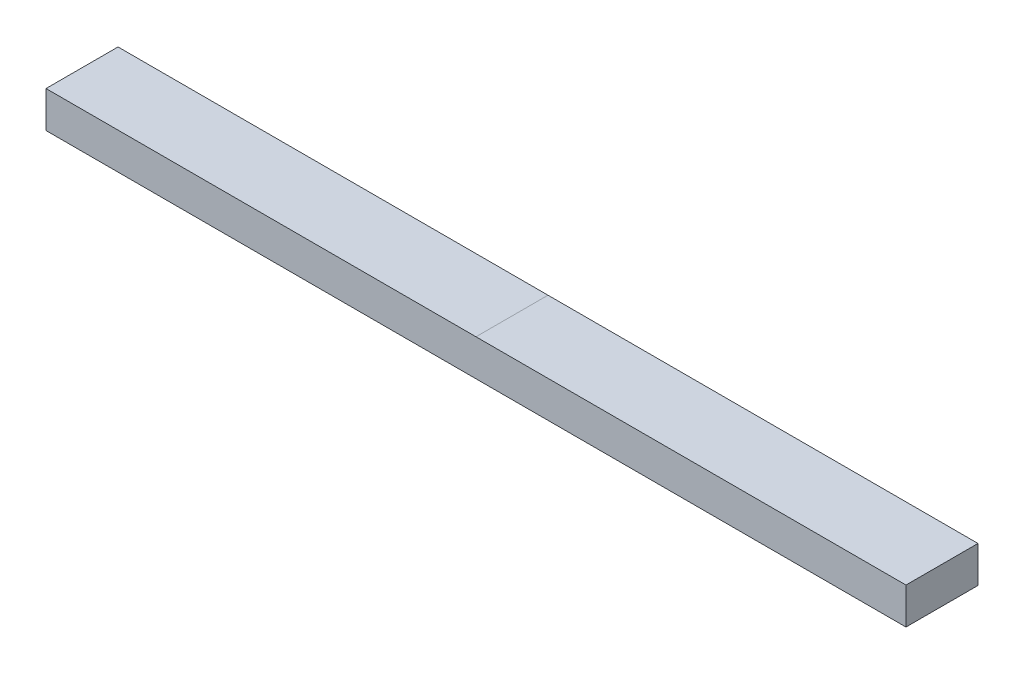
ISO-10303-21;
HEADER;
FILE_DESCRIPTION(('STEP AP214'),'2;1');
FILE_NAME('part.step','',(''),(''),'','','');
FILE_SCHEMA(('AUTOMOTIVE_DESIGN { 1 0 10303 214 1 1 1 1 }'));
ENDSEC;
DATA;
#1=APPLICATION_CONTEXT('core data for automotive mechanical design processes');
#2=APPLICATION_PROTOCOL_DEFINITION('international standard','automotive_design',2000,#1);
#3=PRODUCT_CONTEXT('',#1,'mechanical');
#4=PRODUCT('Part','Part','',(#3));
#5=PRODUCT_RELATED_PRODUCT_CATEGORY('part','',(#4));
#6=PRODUCT_DEFINITION_FORMATION('','',#4);
#7=PRODUCT_DEFINITION_CONTEXT('part definition',#1,'design');
#8=PRODUCT_DEFINITION('design','',#6,#7);
#9=PRODUCT_DEFINITION_SHAPE('','',#8);
#10=(LENGTH_UNIT() NAMED_UNIT(*) SI_UNIT(.MILLI.,.METRE.));
#11=(NAMED_UNIT(*) PLANE_ANGLE_UNIT() SI_UNIT($,.RADIAN.));
#12=(NAMED_UNIT(*) SI_UNIT($,.STERADIAN.) SOLID_ANGLE_UNIT());
#13=UNCERTAINTY_MEASURE_WITH_UNIT(LENGTH_MEASURE(1.E-05),#10,'distance_accuracy_value','');
#14=(GEOMETRIC_REPRESENTATION_CONTEXT(3) GLOBAL_UNCERTAINTY_ASSIGNED_CONTEXT((#13)) GLOBAL_UNIT_ASSIGNED_CONTEXT((#10,
#11,#12)) REPRESENTATION_CONTEXT('',''));
#15=CARTESIAN_POINT('',(0.,0.,0.));
#16=DIRECTION('',(0.,0.,1.));
#17=DIRECTION('',(1.,0.,0.));
#18=AXIS2_PLACEMENT_3D('',#15,#16,#17);
#19=CARTESIAN_POINT('',(76.2,3.2258,6.38175));
#20=DIRECTION('',(0.,1.,0.));
#21=DIRECTION('',(0.,0.,1.));
#22=AXIS2_PLACEMENT_3D('',#19,#20,#21);
#23=PLANE('',#22);
#24=DIRECTION('',(-1.,0.,0.));
#25=VECTOR('',#24,1.);
#26=CARTESIAN_POINT('',(76.2,3.2258,6.38175));
#27=LINE('',#26,#25);
#28=CARTESIAN_POINT('',(0.,3.2258,6.38175));
#29=VERTEX_POINT('',#28);
#30=CARTESIAN_POINT('',(-76.2,3.2258,6.38175));
#31=VERTEX_POINT('',#30);
#32=EDGE_CURVE('E106',#29,#31,#27,.T.);
#33=ORIENTED_EDGE('',*,*,#32,.F.);
#34=DIRECTION('',(0.,0.,-1.));
#35=VECTOR('',#34,1.);
#36=CARTESIAN_POINT('',(0.,3.2258,6.38175));
#37=LINE('',#36,#35);
#38=CARTESIAN_POINT('',(0.,3.2258,-6.38175));
#39=VERTEX_POINT('',#38);
#40=EDGE_CURVE('E13',#29,#39,#37,.T.);
#41=ORIENTED_EDGE('',*,*,#40,.T.);
#42=DIRECTION('',(-1.,0.,0.));
#43=VECTOR('',#42,1.);
#44=CARTESIAN_POINT('',(76.2,3.2258,-6.38175));
#45=LINE('',#44,#43);
#46=CARTESIAN_POINT('',(-76.2,3.2258,-6.38175));
#47=VERTEX_POINT('',#46);
#48=EDGE_CURVE('E105',#39,#47,#45,.T.);
#49=ORIENTED_EDGE('',*,*,#48,.T.);
#50=DIRECTION('',(0.,0.,-1.));
#51=VECTOR('',#50,1.);
#52=CARTESIAN_POINT('',(-76.2,3.2258,6.38175));
#53=LINE('',#52,#51);
#54=EDGE_CURVE('E133',#31,#47,#53,.T.);
#55=ORIENTED_EDGE('',*,*,#54,.F.);
#56=EDGE_LOOP('',(#33,#41,#49,#55));
#57=FACE_BOUND('',#56,.T.);
#58=ADVANCED_FACE('F44',(#57),#23,.T.);
#59=CARTESIAN_POINT('',(76.2,-3.2258,6.38175));
#60=DIRECTION('',(0.,1.,0.));
#61=DIRECTION('',(0.,0.,1.));
#62=AXIS2_PLACEMENT_3D('',#59,#60,#61);
#63=PLANE('',#62);
#64=DIRECTION('',(-1.,0.,0.));
#65=VECTOR('',#64,1.);
#66=CARTESIAN_POINT('',(76.2,-3.2258,6.38175));
#67=LINE('',#66,#65);
#68=CARTESIAN_POINT('',(63.5,-3.2258,6.38175));
#69=VERTEX_POINT('',#68);
#70=CARTESIAN_POINT('',(-63.4999999999999,-3.2258,6.38175));
#71=VERTEX_POINT('',#70);
#72=EDGE_CURVE('E141',#69,#71,#67,.T.);
#73=ORIENTED_EDGE('',*,*,#72,.T.);
#74=DIRECTION('',(0.,0.,-1.));
#75=VECTOR('',#74,1.);
#76=CARTESIAN_POINT('',(-63.5,-3.2258,6.38175));
#77=LINE('',#76,#75);
#78=CARTESIAN_POINT('',(-63.4999999999999,-3.2258,-6.38175));
#79=VERTEX_POINT('',#78);
#80=EDGE_CURVE('E53',#71,#79,#77,.T.);
#81=ORIENTED_EDGE('',*,*,#80,.T.);
#82=DIRECTION('',(-1.,0.,0.));
#83=VECTOR('',#82,1.);
#84=CARTESIAN_POINT('',(76.2,-3.2258,-6.38175));
#85=LINE('',#84,#83);
#86=CARTESIAN_POINT('',(63.5,-3.2258,-6.38175));
#87=VERTEX_POINT('',#86);
#88=EDGE_CURVE('E164',#87,#79,#85,.T.);
#89=ORIENTED_EDGE('',*,*,#88,.F.);
#90=DIRECTION('',(0.,0.,-1.));
#91=VECTOR('',#90,1.);
#92=CARTESIAN_POINT('',(63.5,-3.2258,6.38175));
#93=LINE('',#92,#91);
#94=EDGE_CURVE('E140',#69,#87,#93,.T.);
#95=ORIENTED_EDGE('',*,*,#94,.F.);
#96=EDGE_LOOP('',(#73,#81,#89,#95));
#97=FACE_BOUND('',#96,.T.);
#98=ADVANCED_FACE('F162',(#97),#63,.F.);
#99=CARTESIAN_POINT('',(76.2,-3.2258,6.38175));
#100=VERTEX_POINT('',#99);
#101=EDGE_CURVE('E119',#100,#69,#67,.T.);
#102=ORIENTED_EDGE('',*,*,#101,.T.);
#103=ORIENTED_EDGE('',*,*,#94,.T.);
#104=CARTESIAN_POINT('',(76.2,-3.2258,-6.38175));
#105=VERTEX_POINT('',#104);
#106=EDGE_CURVE('E143',#105,#87,#85,.T.);
#107=ORIENTED_EDGE('',*,*,#106,.F.);
#108=DIRECTION('',(0.,0.,-1.));
#109=VECTOR('',#108,1.);
#110=CARTESIAN_POINT('',(76.2,-3.2258,6.38175));
#111=LINE('',#110,#109);
#112=EDGE_CURVE('E128',#100,#105,#111,.T.);
#113=ORIENTED_EDGE('',*,*,#112,.F.);
#114=EDGE_LOOP('',(#102,#103,#107,#113));
#115=FACE_BOUND('',#114,.T.);
#116=ADVANCED_FACE('F182',(#115),#63,.F.);
#117=CARTESIAN_POINT('',(76.2,-3.2258,6.38175));
#118=DIRECTION('',(0.,0.,1.));
#119=DIRECTION('',(1.,0.,0.));
#120=AXIS2_PLACEMENT_3D('',#117,#118,#119);
#121=PLANE('',#120);
#122=DIRECTION('',(0.,1.,0.));
#123=VECTOR('',#122,1.);
#124=CARTESIAN_POINT('',(-76.2,-3.2258,6.38175));
#125=LINE('',#124,#123);
#126=CARTESIAN_POINT('',(-76.2,-3.2258,6.38175));
#127=VERTEX_POINT('',#126);
#128=EDGE_CURVE('E130',#127,#31,#125,.T.);
#129=ORIENTED_EDGE('',*,*,#128,.F.);
#130=EDGE_CURVE('E142',#71,#127,#67,.T.);
#131=ORIENTED_EDGE('',*,*,#130,.F.);
#132=ORIENTED_EDGE('',*,*,#72,.F.);
#133=ORIENTED_EDGE('',*,*,#101,.F.);
#134=DIRECTION('',(0.,1.,0.));
#135=VECTOR('',#134,1.);
#136=CARTESIAN_POINT('',(76.2,-3.2258,6.38175));
#137=LINE('',#136,#135);
#138=CARTESIAN_POINT('',(76.2,3.2258,6.38175));
#139=VERTEX_POINT('',#138);
#140=EDGE_CURVE('E111',#100,#139,#137,.T.);
#141=ORIENTED_EDGE('',*,*,#140,.T.);
#142=EDGE_CURVE('E99',#139,#29,#27,.T.);
#143=ORIENTED_EDGE('',*,*,#142,.T.);
#144=ORIENTED_EDGE('',*,*,#32,.T.);
#145=EDGE_LOOP('',(#129,#131,#132,#133,#141,#143,#144));
#146=FACE_BOUND('',#145,.T.);
#147=ADVANCED_FACE('F46',(#146),#121,.T.);
#148=ORIENTED_EDGE('',*,*,#80,.F.);
#149=ORIENTED_EDGE('',*,*,#130,.T.);
#150=DIRECTION('',(0.,0.,-1.));
#151=VECTOR('',#150,1.);
#152=CARTESIAN_POINT('',(-76.2,-3.2258,6.38175));
#153=LINE('',#152,#151);
#154=CARTESIAN_POINT('',(-76.2,-3.2258,-6.38175));
#155=VERTEX_POINT('',#154);
#156=EDGE_CURVE('E121',#127,#155,#153,.T.);
#157=ORIENTED_EDGE('',*,*,#156,.T.);
#158=EDGE_CURVE('E168',#79,#155,#85,.T.);
#159=ORIENTED_EDGE('',*,*,#158,.F.);
#160=EDGE_LOOP('',(#148,#149,#157,#159));
#161=FACE_BOUND('',#160,.T.);
#162=ADVANCED_FACE('F169',(#161),#63,.F.);
#163=CARTESIAN_POINT('',(76.2,-3.2258,-6.38175));
#164=DIRECTION('',(0.,0.,1.));
#165=DIRECTION('',(0.,-1.,0.));
#166=AXIS2_PLACEMENT_3D('',#163,#164,#165);
#167=PLANE('',#166);
#168=DIRECTION('',(0.,1.,0.));
#169=VECTOR('',#168,1.);
#170=CARTESIAN_POINT('',(-76.2,-3.2258,-6.38175));
#171=LINE('',#170,#169);
#172=EDGE_CURVE('E124',#155,#47,#171,.T.);
#173=ORIENTED_EDGE('',*,*,#172,.T.);
#174=ORIENTED_EDGE('',*,*,#48,.F.);
#175=CARTESIAN_POINT('',(76.2,3.2258,-6.38175));
#176=VERTEX_POINT('',#175);
#177=EDGE_CURVE('E154',#176,#39,#45,.T.);
#178=ORIENTED_EDGE('',*,*,#177,.F.);
#179=DIRECTION('',(0.,1.,0.));
#180=VECTOR('',#179,1.);
#181=CARTESIAN_POINT('',(76.2,-3.2258,-6.38175));
#182=LINE('',#181,#180);
#183=EDGE_CURVE('E113',#105,#176,#182,.T.);
#184=ORIENTED_EDGE('',*,*,#183,.F.);
#185=ORIENTED_EDGE('',*,*,#106,.T.);
#186=ORIENTED_EDGE('',*,*,#88,.T.);
#187=ORIENTED_EDGE('',*,*,#158,.T.);
#188=EDGE_LOOP('',(#173,#174,#178,#184,#185,#186,#187));
#189=FACE_BOUND('',#188,.T.);
#190=ADVANCED_FACE('F173',(#189),#167,.F.);
#191=ORIENTED_EDGE('',*,*,#40,.F.);
#192=ORIENTED_EDGE('',*,*,#142,.F.);
#193=DIRECTION('',(0.,0.,-1.));
#194=VECTOR('',#193,1.);
#195=CARTESIAN_POINT('',(76.2,3.2258,6.38175));
#196=LINE('',#195,#194);
#197=EDGE_CURVE('E102',#139,#176,#196,.T.);
#198=ORIENTED_EDGE('',*,*,#197,.T.);
#199=ORIENTED_EDGE('',*,*,#177,.T.);
#200=EDGE_LOOP('',(#191,#192,#198,#199));
#201=FACE_BOUND('',#200,.T.);
#202=ADVANCED_FACE('F101',(#201),#23,.T.);
#203=CARTESIAN_POINT('',(76.2,0.,0.));
#204=DIRECTION('',(-1.,0.,0.));
#205=DIRECTION('',(0.,0.,1.));
#206=AXIS2_PLACEMENT_3D('',#203,#204,#205);
#207=PLANE('',#206);
#208=ORIENTED_EDGE('',*,*,#140,.F.);
#209=ORIENTED_EDGE('',*,*,#112,.T.);
#210=ORIENTED_EDGE('',*,*,#183,.T.);
#211=ORIENTED_EDGE('',*,*,#197,.F.);
#212=EDGE_LOOP('',(#208,#209,#210,#211));
#213=FACE_BOUND('',#212,.T.);
#214=ADVANCED_FACE('F110',(#213),#207,.F.);
#215=CARTESIAN_POINT('',(-76.2,0.,0.));
#216=DIRECTION('',(-1.,0.,0.));
#217=DIRECTION('',(0.,0.,1.));
#218=AXIS2_PLACEMENT_3D('',#215,#216,#217);
#219=PLANE('',#218);
#220=ORIENTED_EDGE('',*,*,#128,.T.);
#221=ORIENTED_EDGE('',*,*,#54,.T.);
#222=ORIENTED_EDGE('',*,*,#172,.F.);
#223=ORIENTED_EDGE('',*,*,#156,.F.);
#224=EDGE_LOOP('',(#220,#221,#222,#223));
#225=FACE_BOUND('',#224,.T.);
#226=ADVANCED_FACE('F176',(#225),#219,.T.);
#227=CLOSED_SHELL('',(#58,#98,#116,#147,#162,#190,#202,#214,#226));
#228=MANIFOLD_SOLID_BREP('B2',#227);
#229=ADVANCED_BREP_SHAPE_REPRESENTATION('',(#18,#228),#14);
#230=SHAPE_DEFINITION_REPRESENTATION(#9,#229);
ENDSEC;
END-ISO-10303-21;
